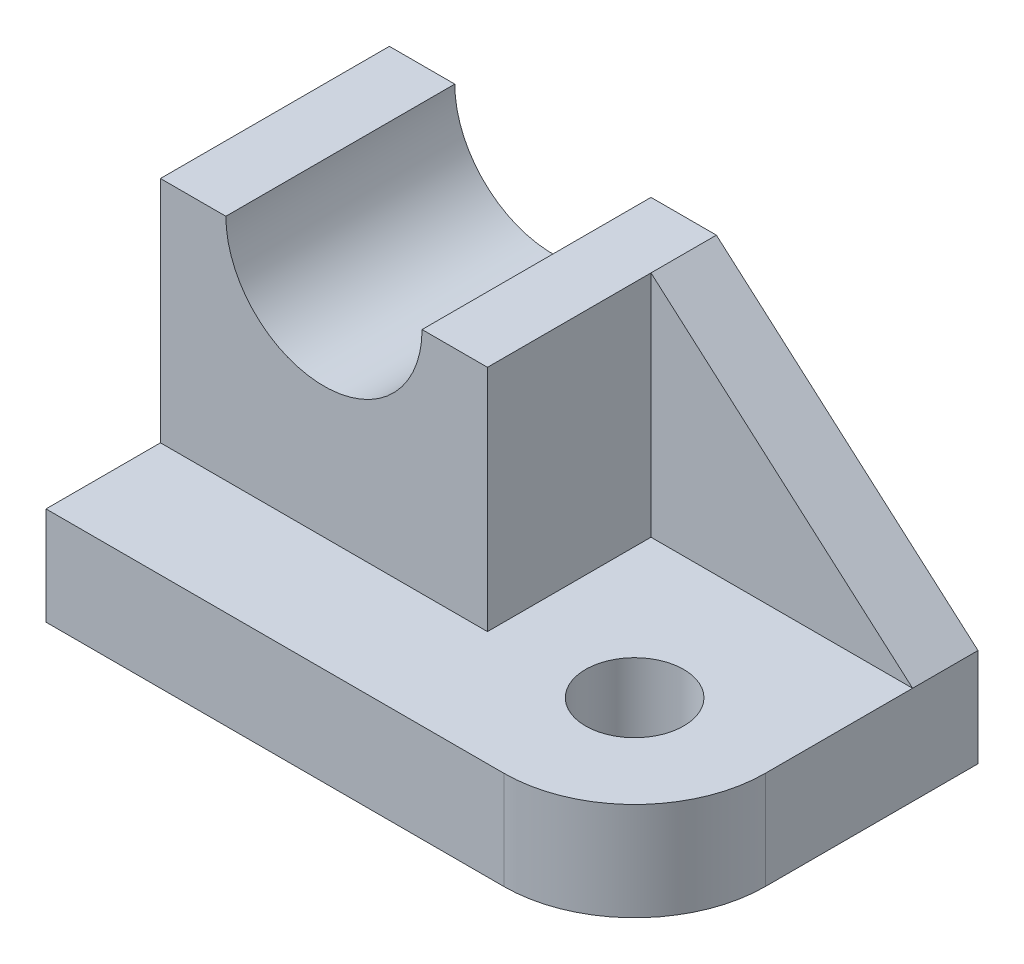
ISO-10303-21;
HEADER;
FILE_DESCRIPTION(('STEP AP214'),'2;1');
FILE_NAME('part.step','',(''),(''),'','','');
FILE_SCHEMA(('AUTOMOTIVE_DESIGN { 1 0 10303 214 1 1 1 1 }'));
ENDSEC;
DATA;
#1=APPLICATION_CONTEXT('core data for automotive mechanical design processes');
#2=APPLICATION_PROTOCOL_DEFINITION('international standard','automotive_design',2000,#1);
#3=PRODUCT_CONTEXT('',#1,'mechanical');
#4=PRODUCT('Part','Part','',(#3));
#5=PRODUCT_RELATED_PRODUCT_CATEGORY('part','',(#4));
#6=PRODUCT_DEFINITION_FORMATION('','',#4);
#7=PRODUCT_DEFINITION_CONTEXT('part definition',#1,'design');
#8=PRODUCT_DEFINITION('design','',#6,#7);
#9=PRODUCT_DEFINITION_SHAPE('','',#8);
#10=(LENGTH_UNIT() NAMED_UNIT(*) SI_UNIT(.MILLI.,.METRE.));
#11=(NAMED_UNIT(*) PLANE_ANGLE_UNIT() SI_UNIT($,.RADIAN.));
#12=(NAMED_UNIT(*) SI_UNIT($,.STERADIAN.) SOLID_ANGLE_UNIT());
#13=UNCERTAINTY_MEASURE_WITH_UNIT(LENGTH_MEASURE(1.E-05),#10,'distance_accuracy_value','');
#14=(GEOMETRIC_REPRESENTATION_CONTEXT(3) GLOBAL_UNCERTAINTY_ASSIGNED_CONTEXT((#13)) GLOBAL_UNIT_ASSIGNED_CONTEXT((#10,
#11,#12)) REPRESENTATION_CONTEXT('',''));
#15=CARTESIAN_POINT('',(0.,0.,0.));
#16=DIRECTION('',(0.,0.,1.));
#17=DIRECTION('',(1.,0.,0.));
#18=AXIS2_PLACEMENT_3D('',#15,#16,#17);
#19=CARTESIAN_POINT('',(0.,40.,0.));
#20=DIRECTION('',(0.,1.,0.));
#21=DIRECTION('',(0.,0.,1.));
#22=AXIS2_PLACEMENT_3D('',#19,#20,#21);
#23=PLANE('',#22);
#24=DIRECTION('',(0.,0.,1.));
#25=VECTOR('',#24,1.);
#26=CARTESIAN_POINT('',(-28.,40.,-21.));
#27=LINE('',#26,#25);
#28=CARTESIAN_POINT('',(-28.,40.,-21.));
#29=VERTEX_POINT('',#28);
#30=CARTESIAN_POINT('',(-28.,40.,7.));
#31=VERTEX_POINT('',#30);
#32=EDGE_CURVE('E236',#29,#31,#27,.T.);
#33=ORIENTED_EDGE('',*,*,#32,.F.);
#34=DIRECTION('',(-1.,0.,0.));
#35=VECTOR('',#34,1.);
#36=CARTESIAN_POINT('',(-36.,40.,-21.));
#37=LINE('',#36,#35);
#38=CARTESIAN_POINT('',(-36.,40.,-21.));
#39=VERTEX_POINT('',#38);
#40=EDGE_CURVE('E188',#29,#39,#37,.T.);
#41=ORIENTED_EDGE('',*,*,#40,.T.);
#42=DIRECTION('',(0.,0.,1.));
#43=VECTOR('',#42,1.);
#44=CARTESIAN_POINT('',(-36.,40.,-21.));
#45=LINE('',#44,#43);
#46=CARTESIAN_POINT('',(-36.,40.,7.));
#47=VERTEX_POINT('',#46);
#48=EDGE_CURVE('E174',#39,#47,#45,.T.);
#49=ORIENTED_EDGE('',*,*,#48,.T.);
#50=DIRECTION('',(1.,0.,0.));
#51=VECTOR('',#50,1.);
#52=CARTESIAN_POINT('',(-36.,40.,7.));
#53=LINE('',#52,#51);
#54=EDGE_CURVE('E180',#47,#31,#53,.T.);
#55=ORIENTED_EDGE('',*,*,#54,.T.);
#56=EDGE_LOOP('',(#33,#41,#49,#55));
#57=FACE_BOUND('',#56,.T.);
#58=ADVANCED_FACE('F39',(#57),#23,.T.);
#59=CARTESIAN_POINT('',(-36.,12.,-21.));
#60=DIRECTION('',(1.,0.,0.));
#61=DIRECTION('',(0.,0.,-1.));
#62=AXIS2_PLACEMENT_3D('',#59,#60,#61);
#63=PLANE('',#62);
#64=DIRECTION('',(0.,0.,1.));
#65=VECTOR('',#64,1.);
#66=CARTESIAN_POINT('',(-36.,0.,-21.));
#67=LINE('',#66,#65);
#68=CARTESIAN_POINT('',(-36.,0.,-21.));
#69=VERTEX_POINT('',#68);
#70=CARTESIAN_POINT('',(-36.,0.,21.));
#71=VERTEX_POINT('',#70);
#72=EDGE_CURVE('E206',#69,#71,#67,.T.);
#73=ORIENTED_EDGE('',*,*,#72,.T.);
#74=DIRECTION('',(0.,-1.,0.));
#75=VECTOR('',#74,1.);
#76=CARTESIAN_POINT('',(-36.,12.,21.));
#77=LINE('',#76,#75);
#78=CARTESIAN_POINT('',(-36.,12.,21.));
#79=VERTEX_POINT('',#78);
#80=EDGE_CURVE('E229',#79,#71,#77,.T.);
#81=ORIENTED_EDGE('',*,*,#80,.F.);
#82=DIRECTION('',(0.,0.,1.));
#83=VECTOR('',#82,1.);
#84=CARTESIAN_POINT('',(-36.,12.,-21.));
#85=LINE('',#84,#83);
#86=CARTESIAN_POINT('',(-36.,12.,6.99999999999999));
#87=VERTEX_POINT('',#86);
#88=EDGE_CURVE('E207',#87,#79,#85,.T.);
#89=ORIENTED_EDGE('',*,*,#88,.F.);
#90=DIRECTION('',(0.,-1.,0.));
#91=VECTOR('',#90,1.);
#92=CARTESIAN_POINT('',(-36.,40.,7.));
#93=LINE('',#92,#91);
#94=EDGE_CURVE('E202',#47,#87,#93,.T.);
#95=ORIENTED_EDGE('',*,*,#94,.F.);
#96=ORIENTED_EDGE('',*,*,#48,.F.);
#97=DIRECTION('',(0.,-1.,0.));
#98=VECTOR('',#97,1.);
#99=CARTESIAN_POINT('',(-36.,12.,-21.));
#100=LINE('',#99,#98);
#101=EDGE_CURVE('E133',#39,#69,#100,.T.);
#102=ORIENTED_EDGE('',*,*,#101,.T.);
#103=EDGE_LOOP('',(#73,#81,#89,#95,#96,#102));
#104=FACE_BOUND('',#103,.T.);
#105=ADVANCED_FACE('F261',(#104),#63,.F.);
#106=CARTESIAN_POINT('',(-36.,12.,21.));
#107=DIRECTION('',(0.,0.,-1.));
#108=DIRECTION('',(-1.,0.,0.));
#109=AXIS2_PLACEMENT_3D('',#106,#107,#108);
#110=PLANE('',#109);
#111=DIRECTION('',(1.,0.,0.));
#112=VECTOR('',#111,1.);
#113=CARTESIAN_POINT('',(-36.,0.,21.));
#114=LINE('',#113,#112);
#115=CARTESIAN_POINT('',(20.,0.,21.));
#116=VERTEX_POINT('',#115);
#117=EDGE_CURVE('E216',#71,#116,#114,.T.);
#118=ORIENTED_EDGE('',*,*,#117,.T.);
#119=DIRECTION('',(0.,-1.,0.));
#120=VECTOR('',#119,1.);
#121=CARTESIAN_POINT('',(20.,12.,21.));
#122=LINE('',#121,#120);
#123=CARTESIAN_POINT('',(20.,12.,21.));
#124=VERTEX_POINT('',#123);
#125=EDGE_CURVE('E48',#116,#124,#122,.F.);
#126=ORIENTED_EDGE('',*,*,#125,.T.);
#127=DIRECTION('',(1.,0.,0.));
#128=VECTOR('',#127,1.);
#129=CARTESIAN_POINT('',(-36.,12.,21.));
#130=LINE('',#129,#128);
#131=EDGE_CURVE('E134',#79,#124,#130,.T.);
#132=ORIENTED_EDGE('',*,*,#131,.F.);
#133=ORIENTED_EDGE('',*,*,#80,.T.);
#134=EDGE_LOOP('',(#118,#126,#132,#133));
#135=FACE_BOUND('',#134,.T.);
#136=ADVANCED_FACE('F271',(#135),#110,.F.);
#137=CARTESIAN_POINT('',(36.,12.,-21.));
#138=DIRECTION('',(-1.,0.,0.));
#139=DIRECTION('',(0.,0.,1.));
#140=AXIS2_PLACEMENT_3D('',#137,#138,#139);
#141=PLANE('',#140);
#142=DIRECTION('',(0.,0.,-1.));
#143=VECTOR('',#142,1.);
#144=CARTESIAN_POINT('',(36.,12.,-21.));
#145=LINE('',#144,#143);
#146=CARTESIAN_POINT('',(36.,12.,4.99999999999999));
#147=VERTEX_POINT('',#146);
#148=CARTESIAN_POINT('',(36.,12.,-13.));
#149=VERTEX_POINT('',#148);
#150=EDGE_CURVE('E122',#147,#149,#145,.T.);
#151=ORIENTED_EDGE('',*,*,#150,.F.);
#152=DIRECTION('',(0.,-1.,0.));
#153=VECTOR('',#152,1.);
#154=CARTESIAN_POINT('',(36.,12.,4.99999999999999));
#155=LINE('',#154,#153);
#156=CARTESIAN_POINT('',(36.,0.,4.99999999999999));
#157=VERTEX_POINT('',#156);
#158=EDGE_CURVE('E239',#147,#157,#155,.T.);
#159=ORIENTED_EDGE('',*,*,#158,.T.);
#160=DIRECTION('',(0.,0.,-1.));
#161=VECTOR('',#160,1.);
#162=CARTESIAN_POINT('',(36.,0.,-21.));
#163=LINE('',#162,#161);
#164=CARTESIAN_POINT('',(36.,0.,-21.));
#165=VERTEX_POINT('',#164);
#166=EDGE_CURVE('E219',#157,#165,#163,.T.);
#167=ORIENTED_EDGE('',*,*,#166,.T.);
#168=DIRECTION('',(0.,-1.,0.));
#169=VECTOR('',#168,1.);
#170=CARTESIAN_POINT('',(36.,12.,-21.));
#171=LINE('',#170,#169);
#172=CARTESIAN_POINT('',(36.,12.,-21.));
#173=VERTEX_POINT('',#172);
#174=EDGE_CURVE('E157',#173,#165,#171,.T.);
#175=ORIENTED_EDGE('',*,*,#174,.F.);
#176=DIRECTION('',(0.,0.,-1.));
#177=VECTOR('',#176,1.);
#178=CARTESIAN_POINT('',(36.,12.,-13.));
#179=LINE('',#178,#177);
#180=EDGE_CURVE('E147',#149,#173,#179,.T.);
#181=ORIENTED_EDGE('',*,*,#180,.F.);
#182=EDGE_LOOP('',(#151,#159,#167,#175,#181));
#183=FACE_BOUND('',#182,.T.);
#184=ADVANCED_FACE('F155',(#183),#141,.F.);
#185=CARTESIAN_POINT('',(-36.,12.,-21.));
#186=DIRECTION('',(0.,0.,1.));
#187=DIRECTION('',(1.,0.,0.));
#188=AXIS2_PLACEMENT_3D('',#185,#186,#187);
#189=PLANE('',#188);
#190=ORIENTED_EDGE('',*,*,#40,.F.);
#191=CARTESIAN_POINT('',(-16.,40.,-21.));
#192=DIRECTION('',(0.,0.,1.));
#193=DIRECTION('',(1.,0.,0.));
#194=AXIS2_PLACEMENT_3D('',#191,#192,#193);
#195=CIRCLE('',#194,12.);
#196=CARTESIAN_POINT('',(-3.99999999999999,40.,-21.));
#197=VERTEX_POINT('',#196);
#198=EDGE_CURVE('E167',#29,#197,#195,.T.);
#199=ORIENTED_EDGE('',*,*,#198,.T.);
#200=CARTESIAN_POINT('',(4.,40.,-21.));
#201=VERTEX_POINT('',#200);
#202=EDGE_CURVE('E189',#201,#197,#37,.T.);
#203=ORIENTED_EDGE('',*,*,#202,.F.);
#204=DIRECTION('',(0.752576694706878,-0.658504607868518,0.));
#205=VECTOR('',#204,1.);
#206=CARTESIAN_POINT('',(36.,12.,-21.));
#207=LINE('',#206,#205);
#208=EDGE_CURVE('E152',#201,#173,#207,.T.);
#209=ORIENTED_EDGE('',*,*,#208,.T.);
#210=ORIENTED_EDGE('',*,*,#174,.T.);
#211=DIRECTION('',(-1.,0.,0.));
#212=VECTOR('',#211,1.);
#213=CARTESIAN_POINT('',(-36.,0.,-21.));
#214=LINE('',#213,#212);
#215=EDGE_CURVE('E210',#165,#69,#214,.T.);
#216=ORIENTED_EDGE('',*,*,#215,.T.);
#217=ORIENTED_EDGE('',*,*,#101,.F.);
#218=EDGE_LOOP('',(#190,#199,#203,#209,#210,#216,#217));
#219=FACE_BOUND('',#218,.T.);
#220=ADVANCED_FACE('F273',(#219),#189,.F.);
#221=CARTESIAN_POINT('',(0.,12.,0.));
#222=DIRECTION('',(0.,1.,0.));
#223=DIRECTION('',(0.,0.,1.));
#224=AXIS2_PLACEMENT_3D('',#221,#222,#223);
#225=PLANE('',#224);
#226=CARTESIAN_POINT('',(20.,12.,4.99999999999999));
#227=DIRECTION('',(0.,1.,0.));
#228=DIRECTION('',(0.,0.,1.));
#229=AXIS2_PLACEMENT_3D('',#226,#227,#228);
#230=CIRCLE('',#229,6.);
#231=CARTESIAN_POINT('',(20.,12.,11.));
#232=VERTEX_POINT('',#231);
#233=EDGE_CURVE('E279',#232,#232,#230,.T.);
#234=ORIENTED_EDGE('',*,*,#233,.F.);
#235=EDGE_LOOP('',(#234));
#236=FACE_BOUND('',#235,.T.);
#237=ORIENTED_EDGE('',*,*,#131,.T.);
#238=CARTESIAN_POINT('',(20.,12.,5.));
#239=DIRECTION('',(0.,1.,0.));
#240=DIRECTION('',(0.,0.,1.));
#241=AXIS2_PLACEMENT_3D('',#238,#239,#240);
#242=CIRCLE('',#241,16.);
#243=EDGE_CURVE('E11',#124,#147,#242,.T.);
#244=ORIENTED_EDGE('',*,*,#243,.T.);
#245=ORIENTED_EDGE('',*,*,#150,.T.);
#246=DIRECTION('',(-1.,0.,0.));
#247=VECTOR('',#246,1.);
#248=CARTESIAN_POINT('',(4.,12.,-13.));
#249=LINE('',#248,#247);
#250=CARTESIAN_POINT('',(4.,12.,-13.));
#251=VERTEX_POINT('',#250);
#252=EDGE_CURVE('E125',#149,#251,#249,.T.);
#253=ORIENTED_EDGE('',*,*,#252,.T.);
#254=DIRECTION('',(0.,0.,-1.));
#255=VECTOR('',#254,1.);
#256=CARTESIAN_POINT('',(4.,12.,-21.));
#257=LINE('',#256,#255);
#258=CARTESIAN_POINT('',(4.,12.,7.));
#259=VERTEX_POINT('',#258);
#260=EDGE_CURVE('E179',#259,#251,#257,.T.);
#261=ORIENTED_EDGE('',*,*,#260,.F.);
#262=DIRECTION('',(1.,0.,0.));
#263=VECTOR('',#262,1.);
#264=CARTESIAN_POINT('',(-36.,12.,7.));
#265=LINE('',#264,#263);
#266=EDGE_CURVE('E171',#87,#259,#265,.T.);
#267=ORIENTED_EDGE('',*,*,#266,.F.);
#268=ORIENTED_EDGE('',*,*,#88,.T.);
#269=EDGE_LOOP('',(#237,#244,#245,#253,#261,#267,#268));
#270=FACE_BOUND('',#269,.T.);
#271=ADVANCED_FACE('F124',(#236,#270),#225,.T.);
#272=CARTESIAN_POINT('',(0.,0.,0.));
#273=DIRECTION('',(0.,1.,0.));
#274=DIRECTION('',(0.,0.,1.));
#275=AXIS2_PLACEMENT_3D('',#272,#273,#274);
#276=PLANE('',#275);
#277=CARTESIAN_POINT('',(20.,0.,4.99999999999999));
#278=DIRECTION('',(0.,1.,0.));
#279=DIRECTION('',(0.,0.,1.));
#280=AXIS2_PLACEMENT_3D('',#277,#278,#279);
#281=CIRCLE('',#280,6.);
#282=CARTESIAN_POINT('',(20.,0.,11.));
#283=VERTEX_POINT('',#282);
#284=EDGE_CURVE('E276',#283,#283,#281,.T.);
#285=ORIENTED_EDGE('',*,*,#284,.T.);
#286=EDGE_LOOP('',(#285));
#287=FACE_BOUND('',#286,.T.);
#288=ORIENTED_EDGE('',*,*,#166,.F.);
#289=CARTESIAN_POINT('',(20.,0.,5.));
#290=DIRECTION('',(0.,1.,0.));
#291=DIRECTION('',(0.,0.,1.));
#292=AXIS2_PLACEMENT_3D('',#289,#290,#291);
#293=CIRCLE('',#292,16.);
#294=EDGE_CURVE('E62',#157,#116,#293,.F.);
#295=ORIENTED_EDGE('',*,*,#294,.T.);
#296=ORIENTED_EDGE('',*,*,#117,.F.);
#297=ORIENTED_EDGE('',*,*,#72,.F.);
#298=ORIENTED_EDGE('',*,*,#215,.F.);
#299=EDGE_LOOP('',(#288,#295,#296,#297,#298));
#300=FACE_BOUND('',#299,.T.);
#301=ADVANCED_FACE('F270',(#287,#300),#276,.F.);
#302=CARTESIAN_POINT('',(-36.,40.,7.));
#303=DIRECTION('',(0.,0.,-1.));
#304=DIRECTION('',(-1.,0.,0.));
#305=AXIS2_PLACEMENT_3D('',#302,#303,#304);
#306=PLANE('',#305);
#307=CARTESIAN_POINT('',(-4.,40.,7.));
#308=VERTEX_POINT('',#307);
#309=CARTESIAN_POINT('',(4.,40.,7.));
#310=VERTEX_POINT('',#309);
#311=EDGE_CURVE('E178',#308,#310,#53,.T.);
#312=ORIENTED_EDGE('',*,*,#311,.F.);
#313=CARTESIAN_POINT('',(-16.,40.,7.));
#314=DIRECTION('',(0.,0.,1.));
#315=DIRECTION('',(1.,0.,0.));
#316=AXIS2_PLACEMENT_3D('',#313,#314,#315);
#317=CIRCLE('',#316,12.);
#318=EDGE_CURVE('E162',#31,#308,#317,.T.);
#319=ORIENTED_EDGE('',*,*,#318,.F.);
#320=ORIENTED_EDGE('',*,*,#54,.F.);
#321=ORIENTED_EDGE('',*,*,#94,.T.);
#322=ORIENTED_EDGE('',*,*,#266,.T.);
#323=DIRECTION('',(0.,-1.,0.));
#324=VECTOR('',#323,1.);
#325=CARTESIAN_POINT('',(4.,40.,7.));
#326=LINE('',#325,#324);
#327=EDGE_CURVE('E193',#310,#259,#326,.T.);
#328=ORIENTED_EDGE('',*,*,#327,.F.);
#329=EDGE_LOOP('',(#312,#319,#320,#321,#322,#328));
#330=FACE_BOUND('',#329,.T.);
#331=ADVANCED_FACE('F254',(#330),#306,.F.);
#332=CARTESIAN_POINT('',(4.,40.,-21.));
#333=DIRECTION('',(-1.,0.,0.));
#334=DIRECTION('',(0.,0.,1.));
#335=AXIS2_PLACEMENT_3D('',#332,#333,#334);
#336=PLANE('',#335);
#337=ORIENTED_EDGE('',*,*,#260,.T.);
#338=DIRECTION('',(0.,1.,0.));
#339=VECTOR('',#338,1.);
#340=CARTESIAN_POINT('',(4.,40.,-13.));
#341=LINE('',#340,#339);
#342=CARTESIAN_POINT('',(4.,40.,-13.));
#343=VERTEX_POINT('',#342);
#344=EDGE_CURVE('E142',#251,#343,#341,.T.);
#345=ORIENTED_EDGE('',*,*,#344,.T.);
#346=DIRECTION('',(0.,0.,-1.));
#347=VECTOR('',#346,1.);
#348=CARTESIAN_POINT('',(4.,40.,-21.));
#349=LINE('',#348,#347);
#350=EDGE_CURVE('E184',#310,#343,#349,.T.);
#351=ORIENTED_EDGE('',*,*,#350,.F.);
#352=ORIENTED_EDGE('',*,*,#327,.T.);
#353=EDGE_LOOP('',(#337,#345,#351,#352));
#354=FACE_BOUND('',#353,.T.);
#355=ADVANCED_FACE('F256',(#354),#336,.F.);
#356=DIRECTION('',(0.,0.,1.));
#357=VECTOR('',#356,1.);
#358=CARTESIAN_POINT('',(-3.99999999999999,40.,-21.));
#359=LINE('',#358,#357);
#360=EDGE_CURVE('E233',#308,#197,#359,.F.);
#361=ORIENTED_EDGE('',*,*,#360,.F.);
#362=ORIENTED_EDGE('',*,*,#311,.T.);
#363=ORIENTED_EDGE('',*,*,#350,.T.);
#364=DIRECTION('',(0.,0.,-1.));
#365=VECTOR('',#364,1.);
#366=CARTESIAN_POINT('',(4.,40.,-13.));
#367=LINE('',#366,#365);
#368=EDGE_CURVE('E150',#343,#201,#367,.T.);
#369=ORIENTED_EDGE('',*,*,#368,.T.);
#370=ORIENTED_EDGE('',*,*,#202,.T.);
#371=EDGE_LOOP('',(#361,#362,#363,#369,#370));
#372=FACE_BOUND('',#371,.T.);
#373=ADVANCED_FACE('F250',(#372),#23,.T.);
#374=CARTESIAN_POINT('',(-16.,40.,-21.));
#375=DIRECTION('',(0.,0.,1.));
#376=DIRECTION('',(1.,0.,0.));
#377=AXIS2_PLACEMENT_3D('',#374,#375,#376);
#378=CYLINDRICAL_SURFACE('',#377,12.);
#379=ORIENTED_EDGE('',*,*,#32,.T.);
#380=ORIENTED_EDGE('',*,*,#318,.T.);
#381=ORIENTED_EDGE('',*,*,#360,.T.);
#382=ORIENTED_EDGE('',*,*,#198,.F.);
#383=EDGE_LOOP('',(#379,#380,#381,#382));
#384=FACE_BOUND('',#383,.T.);
#385=ADVANCED_FACE('F306',(#384),#378,.F.);
#386=CARTESIAN_POINT('',(36.,12.,-13.));
#387=DIRECTION('',(0.658504607868518,0.752576694706878,0.));
#388=DIRECTION('',(-0.752576694706878,0.658504607868518,0.));
#389=AXIS2_PLACEMENT_3D('',#386,#387,#388);
#390=PLANE('',#389);
#391=ORIENTED_EDGE('',*,*,#208,.F.);
#392=ORIENTED_EDGE('',*,*,#368,.F.);
#393=DIRECTION('',(0.752576694706878,-0.658504607868518,0.));
#394=VECTOR('',#393,1.);
#395=CARTESIAN_POINT('',(36.,12.,-13.));
#396=LINE('',#395,#394);
#397=EDGE_CURVE('E140',#343,#149,#396,.T.);
#398=ORIENTED_EDGE('',*,*,#397,.T.);
#399=ORIENTED_EDGE('',*,*,#180,.T.);
#400=EDGE_LOOP('',(#391,#392,#398,#399));
#401=FACE_BOUND('',#400,.T.);
#402=ADVANCED_FACE('F146',(#401),#390,.T.);
#403=CARTESIAN_POINT('',(0.,0.,-13.));
#404=DIRECTION('',(0.,0.,1.));
#405=DIRECTION('',(1.,0.,0.));
#406=AXIS2_PLACEMENT_3D('',#403,#404,#405);
#407=PLANE('',#406);
#408=ORIENTED_EDGE('',*,*,#397,.F.);
#409=ORIENTED_EDGE('',*,*,#344,.F.);
#410=ORIENTED_EDGE('',*,*,#252,.F.);
#411=EDGE_LOOP('',(#408,#409,#410));
#412=FACE_BOUND('',#411,.T.);
#413=ADVANCED_FACE('F139',(#412),#407,.T.);
#414=CARTESIAN_POINT('',(20.,12.,5.));
#415=DIRECTION('',(0.,-1.,0.));
#416=DIRECTION('',(0.,0.,-1.));
#417=AXIS2_PLACEMENT_3D('',#414,#415,#416);
#418=CYLINDRICAL_SURFACE('',#417,16.);
#419=ORIENTED_EDGE('',*,*,#243,.F.);
#420=ORIENTED_EDGE('',*,*,#125,.F.);
#421=ORIENTED_EDGE('',*,*,#294,.F.);
#422=ORIENTED_EDGE('',*,*,#158,.F.);
#423=EDGE_LOOP('',(#419,#420,#421,#422));
#424=FACE_BOUND('',#423,.T.);
#425=ADVANCED_FACE('F41',(#424),#418,.T.);
#426=CARTESIAN_POINT('',(20.,0.,4.99999999999999));
#427=DIRECTION('',(0.,1.,0.));
#428=DIRECTION('',(0.,0.,1.));
#429=AXIS2_PLACEMENT_3D('',#426,#427,#428);
#430=CYLINDRICAL_SURFACE('',#429,6.);
#431=ORIENTED_EDGE('',*,*,#284,.F.);
#432=EDGE_LOOP('',(#431));
#433=FACE_BOUND('',#432,.T.);
#434=ORIENTED_EDGE('',*,*,#233,.T.);
#435=EDGE_LOOP('',(#434));
#436=FACE_BOUND('',#435,.T.);
#437=ADVANCED_FACE('F286',(#433,#436),#430,.F.);
#438=CLOSED_SHELL('',(#58,#105,#136,#184,#220,#271,#301,#331,#355,#373,#385,#402,#413,#425,#437));
#439=MANIFOLD_SOLID_BREP('B2',#438);
#440=ADVANCED_BREP_SHAPE_REPRESENTATION('',(#18,#439),#14);
#441=SHAPE_DEFINITION_REPRESENTATION(#9,#440);
ENDSEC;
END-ISO-10303-21;
